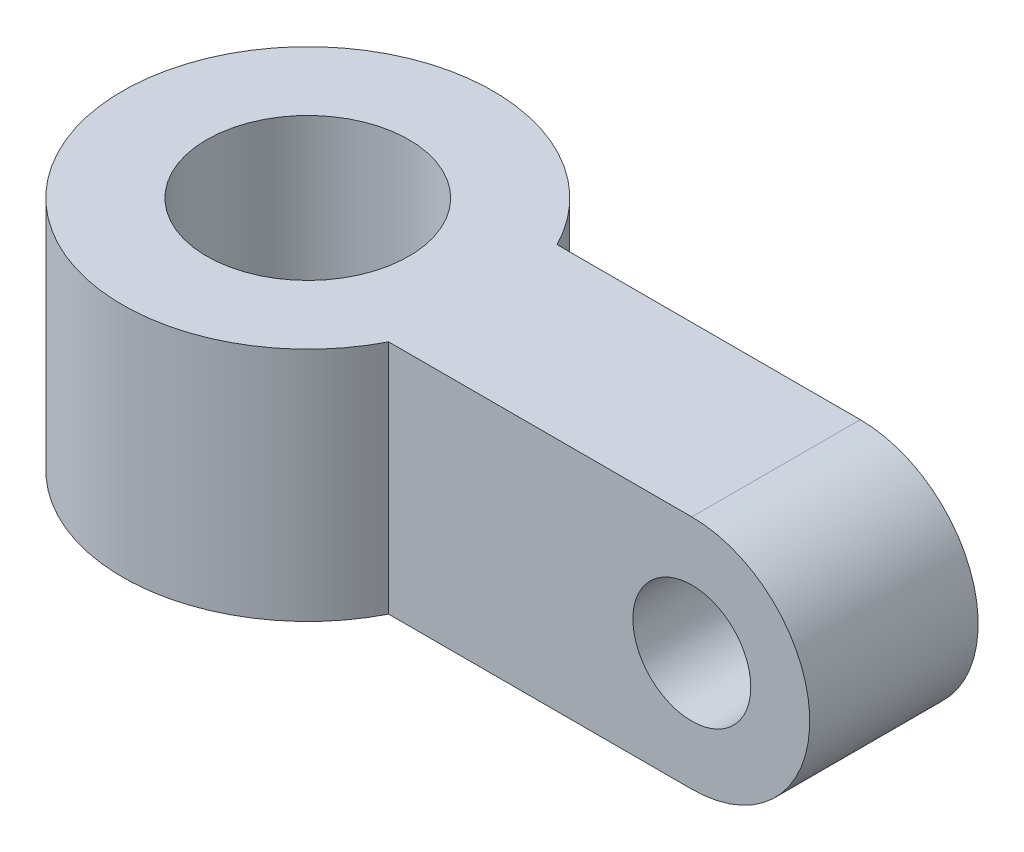
ISO-10303-21;
HEADER;
FILE_DESCRIPTION(('STEP AP214'),'2;1');
FILE_NAME('part.step','',(''),(''),'','','');
FILE_SCHEMA(('AUTOMOTIVE_DESIGN { 1 0 10303 214 1 1 1 1 }'));
ENDSEC;
DATA;
#1=APPLICATION_CONTEXT('core data for automotive mechanical design processes');
#2=APPLICATION_PROTOCOL_DEFINITION('international standard','automotive_design',2000,#1);
#3=PRODUCT_CONTEXT('',#1,'mechanical');
#4=PRODUCT('Part','Part','',(#3));
#5=PRODUCT_RELATED_PRODUCT_CATEGORY('part','',(#4));
#6=PRODUCT_DEFINITION_FORMATION('','',#4);
#7=PRODUCT_DEFINITION_CONTEXT('part definition',#1,'design');
#8=PRODUCT_DEFINITION('design','',#6,#7);
#9=PRODUCT_DEFINITION_SHAPE('','',#8);
#10=(LENGTH_UNIT() NAMED_UNIT(*) SI_UNIT(.MILLI.,.METRE.));
#11=(NAMED_UNIT(*) PLANE_ANGLE_UNIT() SI_UNIT($,.RADIAN.));
#12=(NAMED_UNIT(*) SI_UNIT($,.STERADIAN.) SOLID_ANGLE_UNIT());
#13=UNCERTAINTY_MEASURE_WITH_UNIT(LENGTH_MEASURE(1.E-05),#10,'distance_accuracy_value','');
#14=(GEOMETRIC_REPRESENTATION_CONTEXT(3) GLOBAL_UNCERTAINTY_ASSIGNED_CONTEXT((#13)) GLOBAL_UNIT_ASSIGNED_CONTEXT((#10,
#11,#12)) REPRESENTATION_CONTEXT('',''));
#15=CARTESIAN_POINT('',(0.,0.,0.));
#16=DIRECTION('',(0.,0.,1.));
#17=DIRECTION('',(1.,0.,0.));
#18=AXIS2_PLACEMENT_3D('',#15,#16,#17);
#19=CARTESIAN_POINT('',(0.,0.,5.));
#20=DIRECTION('',(0.,0.,1.));
#21=DIRECTION('',(1.,0.,0.));
#22=AXIS2_PLACEMENT_3D('',#19,#20,#21);
#23=PLANE('',#22);
#24=CARTESIAN_POINT('',(0.,0.,5.));
#25=DIRECTION('',(0.,0.,1.));
#26=DIRECTION('',(1.,0.,0.));
#27=AXIS2_PLACEMENT_3D('',#24,#25,#26);
#28=CIRCLE('',#27,3.5);
#29=CARTESIAN_POINT('',(0.,-3.5,5.));
#30=VERTEX_POINT('',#29);
#31=CARTESIAN_POINT('',(0.,3.5,5.));
#32=VERTEX_POINT('',#31);
#33=EDGE_CURVE('E82',#30,#32,#28,.T.);
#34=ORIENTED_EDGE('',*,*,#33,.T.);
#35=DIRECTION('',(-1.,0.,0.));
#36=VECTOR('',#35,1.);
#37=CARTESIAN_POINT('',(0.,3.5,5.));
#38=LINE('',#37,#36);
#39=CARTESIAN_POINT('',(-9.,3.5,5.));
#40=VERTEX_POINT('',#39);
#41=EDGE_CURVE('E76',#32,#40,#38,.T.);
#42=ORIENTED_EDGE('',*,*,#41,.T.);
#43=DIRECTION('',(0.,1.,0.));
#44=VECTOR('',#43,1.);
#45=CARTESIAN_POINT('',(-9.,-3.5,5.));
#46=LINE('',#45,#44);
#47=CARTESIAN_POINT('',(-9.,-3.5,5.));
#48=VERTEX_POINT('',#47);
#49=EDGE_CURVE('E79',#48,#40,#46,.T.);
#50=ORIENTED_EDGE('',*,*,#49,.F.);
#51=DIRECTION('',(1.,0.,0.));
#52=VECTOR('',#51,1.);
#53=CARTESIAN_POINT('',(0.,-3.5,5.));
#54=LINE('',#53,#52);
#55=EDGE_CURVE('E52',#48,#30,#54,.T.);
#56=ORIENTED_EDGE('',*,*,#55,.T.);
#57=EDGE_LOOP('',(#34,#42,#50,#56));
#58=FACE_BOUND('',#57,.T.);
#59=CARTESIAN_POINT('',(0.,0.,5.));
#60=DIRECTION('',(0.,0.,1.));
#61=DIRECTION('',(1.,0.,0.));
#62=AXIS2_PLACEMENT_3D('',#59,#60,#61);
#63=CIRCLE('',#62,1.75);
#64=CARTESIAN_POINT('',(1.75,0.,5.));
#65=VERTEX_POINT('',#64);
#66=EDGE_CURVE('E108',#65,#65,#63,.T.);
#67=ORIENTED_EDGE('',*,*,#66,.F.);
#68=EDGE_LOOP('',(#67));
#69=FACE_BOUND('',#68,.T.);
#70=ADVANCED_FACE('F35',(#58,#69),#23,.T.);
#71=CARTESIAN_POINT('',(0.,0.,0.));
#72=DIRECTION('',(0.,0.,1.));
#73=DIRECTION('',(1.,0.,0.));
#74=AXIS2_PLACEMENT_3D('',#71,#72,#73);
#75=PLANE('',#74);
#76=CARTESIAN_POINT('',(0.,0.,0.));
#77=DIRECTION('',(0.,0.,1.));
#78=DIRECTION('',(1.,0.,0.));
#79=AXIS2_PLACEMENT_3D('',#76,#77,#78);
#80=CIRCLE('',#79,3.5);
#81=CARTESIAN_POINT('',(0.,-3.5,0.));
#82=VERTEX_POINT('',#81);
#83=CARTESIAN_POINT('',(0.,3.5,0.));
#84=VERTEX_POINT('',#83);
#85=EDGE_CURVE('E111',#82,#84,#80,.T.);
#86=ORIENTED_EDGE('',*,*,#85,.F.);
#87=DIRECTION('',(1.,0.,0.));
#88=VECTOR('',#87,1.);
#89=CARTESIAN_POINT('',(0.,-3.5,0.));
#90=LINE('',#89,#88);
#91=CARTESIAN_POINT('',(-9.,-3.5,0.));
#92=VERTEX_POINT('',#91);
#93=EDGE_CURVE('E114',#92,#82,#90,.T.);
#94=ORIENTED_EDGE('',*,*,#93,.F.);
#95=DIRECTION('',(0.,1.,0.));
#96=VECTOR('',#95,1.);
#97=CARTESIAN_POINT('',(-9.,-3.5,0.));
#98=LINE('',#97,#96);
#99=CARTESIAN_POINT('',(-9.,3.5,0.));
#100=VERTEX_POINT('',#99);
#101=EDGE_CURVE('E94',#92,#100,#98,.T.);
#102=ORIENTED_EDGE('',*,*,#101,.T.);
#103=DIRECTION('',(-1.,0.,0.));
#104=VECTOR('',#103,1.);
#105=CARTESIAN_POINT('',(0.,3.5,0.));
#106=LINE('',#105,#104);
#107=EDGE_CURVE('E64',#84,#100,#106,.T.);
#108=ORIENTED_EDGE('',*,*,#107,.F.);
#109=EDGE_LOOP('',(#86,#94,#102,#108));
#110=FACE_BOUND('',#109,.T.);
#111=CARTESIAN_POINT('',(0.,0.,0.));
#112=DIRECTION('',(0.,0.,1.));
#113=DIRECTION('',(1.,0.,0.));
#114=AXIS2_PLACEMENT_3D('',#111,#112,#113);
#115=CIRCLE('',#114,1.75);
#116=CARTESIAN_POINT('',(1.75,0.,0.));
#117=VERTEX_POINT('',#116);
#118=EDGE_CURVE('E93',#117,#117,#115,.T.);
#119=ORIENTED_EDGE('',*,*,#118,.T.);
#120=EDGE_LOOP('',(#119));
#121=FACE_BOUND('',#120,.T.);
#122=ADVANCED_FACE('F122',(#110,#121),#75,.F.);
#123=CARTESIAN_POINT('',(0.,0.,5.));
#124=DIRECTION('',(0.,0.,-1.));
#125=DIRECTION('',(-1.,0.,0.));
#126=AXIS2_PLACEMENT_3D('',#123,#124,#125);
#127=CYLINDRICAL_SURFACE('',#126,3.5);
#128=ORIENTED_EDGE('',*,*,#85,.T.);
#129=DIRECTION('',(0.,0.,-1.));
#130=VECTOR('',#129,1.);
#131=CARTESIAN_POINT('',(0.,3.5,5.));
#132=LINE('',#131,#130);
#133=EDGE_CURVE('E11',#32,#84,#132,.T.);
#134=ORIENTED_EDGE('',*,*,#133,.F.);
#135=ORIENTED_EDGE('',*,*,#33,.F.);
#136=DIRECTION('',(0.,0.,-1.));
#137=VECTOR('',#136,1.);
#138=CARTESIAN_POINT('',(0.,-3.5,5.));
#139=LINE('',#138,#137);
#140=EDGE_CURVE('E44',#30,#82,#139,.T.);
#141=ORIENTED_EDGE('',*,*,#140,.T.);
#142=EDGE_LOOP('',(#128,#134,#135,#141));
#143=FACE_BOUND('',#142,.T.);
#144=ADVANCED_FACE('F37',(#143),#127,.T.);
#145=CARTESIAN_POINT('',(0.,3.5,5.));
#146=DIRECTION('',(0.,-1.,0.));
#147=DIRECTION('',(1.,0.,0.));
#148=AXIS2_PLACEMENT_3D('',#145,#146,#147);
#149=PLANE('',#148);
#150=ORIENTED_EDGE('',*,*,#107,.T.);
#151=CARTESIAN_POINT('',(-13.8989794855664,3.5,2.5));
#152=DIRECTION('',(0.,1.,0.));
#153=DIRECTION('',(-1.,0.,0.));
#154=AXIS2_PLACEMENT_3D('',#151,#152,#153);
#155=CIRCLE('',#154,5.5);
#156=EDGE_CURVE('E91',#100,#40,#155,.T.);
#157=ORIENTED_EDGE('',*,*,#156,.T.);
#158=ORIENTED_EDGE('',*,*,#41,.F.);
#159=ORIENTED_EDGE('',*,*,#133,.T.);
#160=EDGE_LOOP('',(#150,#157,#158,#159));
#161=FACE_BOUND('',#160,.T.);
#162=CARTESIAN_POINT('',(-13.8989794855664,3.5,2.5));
#163=DIRECTION('',(0.,1.,0.));
#164=DIRECTION('',(-1.,0.,0.));
#165=AXIS2_PLACEMENT_3D('',#162,#163,#164);
#166=CIRCLE('',#165,3.);
#167=CARTESIAN_POINT('',(-16.8989794855664,3.5,2.5));
#168=VERTEX_POINT('',#167);
#169=EDGE_CURVE('E99',#168,#168,#166,.T.);
#170=ORIENTED_EDGE('',*,*,#169,.F.);
#171=EDGE_LOOP('',(#170));
#172=FACE_BOUND('',#171,.T.);
#173=ADVANCED_FACE('F96',(#161,#172),#149,.F.);
#174=CARTESIAN_POINT('',(0.,-3.5,5.));
#175=DIRECTION('',(0.,1.,0.));
#176=DIRECTION('',(-1.,0.,0.));
#177=AXIS2_PLACEMENT_3D('',#174,#175,#176);
#178=PLANE('',#177);
#179=ORIENTED_EDGE('',*,*,#93,.T.);
#180=ORIENTED_EDGE('',*,*,#140,.F.);
#181=ORIENTED_EDGE('',*,*,#55,.F.);
#182=CARTESIAN_POINT('',(-13.8989794855664,-3.5,2.5));
#183=DIRECTION('',(0.,1.,0.));
#184=DIRECTION('',(-1.,0.,0.));
#185=AXIS2_PLACEMENT_3D('',#182,#183,#184);
#186=CIRCLE('',#185,5.5);
#187=EDGE_CURVE('E92',#92,#48,#186,.T.);
#188=ORIENTED_EDGE('',*,*,#187,.F.);
#189=EDGE_LOOP('',(#179,#180,#181,#188));
#190=FACE_BOUND('',#189,.T.);
#191=CARTESIAN_POINT('',(-13.8989794855664,-3.5,2.5));
#192=DIRECTION('',(0.,1.,0.));
#193=DIRECTION('',(-1.,0.,0.));
#194=AXIS2_PLACEMENT_3D('',#191,#192,#193);
#195=CIRCLE('',#194,3.);
#196=CARTESIAN_POINT('',(-16.8989794855664,-3.5,2.5));
#197=VERTEX_POINT('',#196);
#198=EDGE_CURVE('E98',#197,#197,#195,.T.);
#199=ORIENTED_EDGE('',*,*,#198,.T.);
#200=EDGE_LOOP('',(#199));
#201=FACE_BOUND('',#200,.T.);
#202=ADVANCED_FACE('F124',(#190,#201),#178,.F.);
#203=CARTESIAN_POINT('',(0.,0.,5.));
#204=DIRECTION('',(0.,0.,-1.));
#205=DIRECTION('',(-1.,0.,0.));
#206=AXIS2_PLACEMENT_3D('',#203,#204,#205);
#207=CYLINDRICAL_SURFACE('',#206,1.75);
#208=ORIENTED_EDGE('',*,*,#66,.T.);
#209=EDGE_LOOP('',(#208));
#210=FACE_BOUND('',#209,.T.);
#211=ORIENTED_EDGE('',*,*,#118,.F.);
#212=EDGE_LOOP('',(#211));
#213=FACE_BOUND('',#212,.T.);
#214=ADVANCED_FACE('F127',(#210,#213),#207,.F.);
#215=CARTESIAN_POINT('',(-13.8989794855664,-3.5,2.5));
#216=DIRECTION('',(0.,1.,0.));
#217=DIRECTION('',(-1.,0.,0.));
#218=AXIS2_PLACEMENT_3D('',#215,#216,#217);
#219=CYLINDRICAL_SURFACE('',#218,3.);
#220=ORIENTED_EDGE('',*,*,#198,.F.);
#221=EDGE_LOOP('',(#220));
#222=FACE_BOUND('',#221,.T.);
#223=ORIENTED_EDGE('',*,*,#169,.T.);
#224=EDGE_LOOP('',(#223));
#225=FACE_BOUND('',#224,.T.);
#226=ADVANCED_FACE('F131',(#222,#225),#219,.F.);
#227=CARTESIAN_POINT('',(-13.8989794855664,-3.5,2.5));
#228=DIRECTION('',(0.,1.,0.));
#229=DIRECTION('',(-1.,0.,0.));
#230=AXIS2_PLACEMENT_3D('',#227,#228,#229);
#231=CYLINDRICAL_SURFACE('',#230,5.5);
#232=ORIENTED_EDGE('',*,*,#156,.F.);
#233=ORIENTED_EDGE('',*,*,#101,.F.);
#234=ORIENTED_EDGE('',*,*,#187,.T.);
#235=ORIENTED_EDGE('',*,*,#49,.T.);
#236=EDGE_LOOP('',(#232,#233,#234,#235));
#237=FACE_BOUND('',#236,.T.);
#238=ADVANCED_FACE('F89',(#237),#231,.T.);
#239=CLOSED_SHELL('',(#70,#122,#144,#173,#202,#214,#226,#238));
#240=MANIFOLD_SOLID_BREP('B2',#239);
#241=ADVANCED_BREP_SHAPE_REPRESENTATION('',(#18,#240),#14);
#242=SHAPE_DEFINITION_REPRESENTATION(#9,#241);
ENDSEC;
END-ISO-10303-21;
